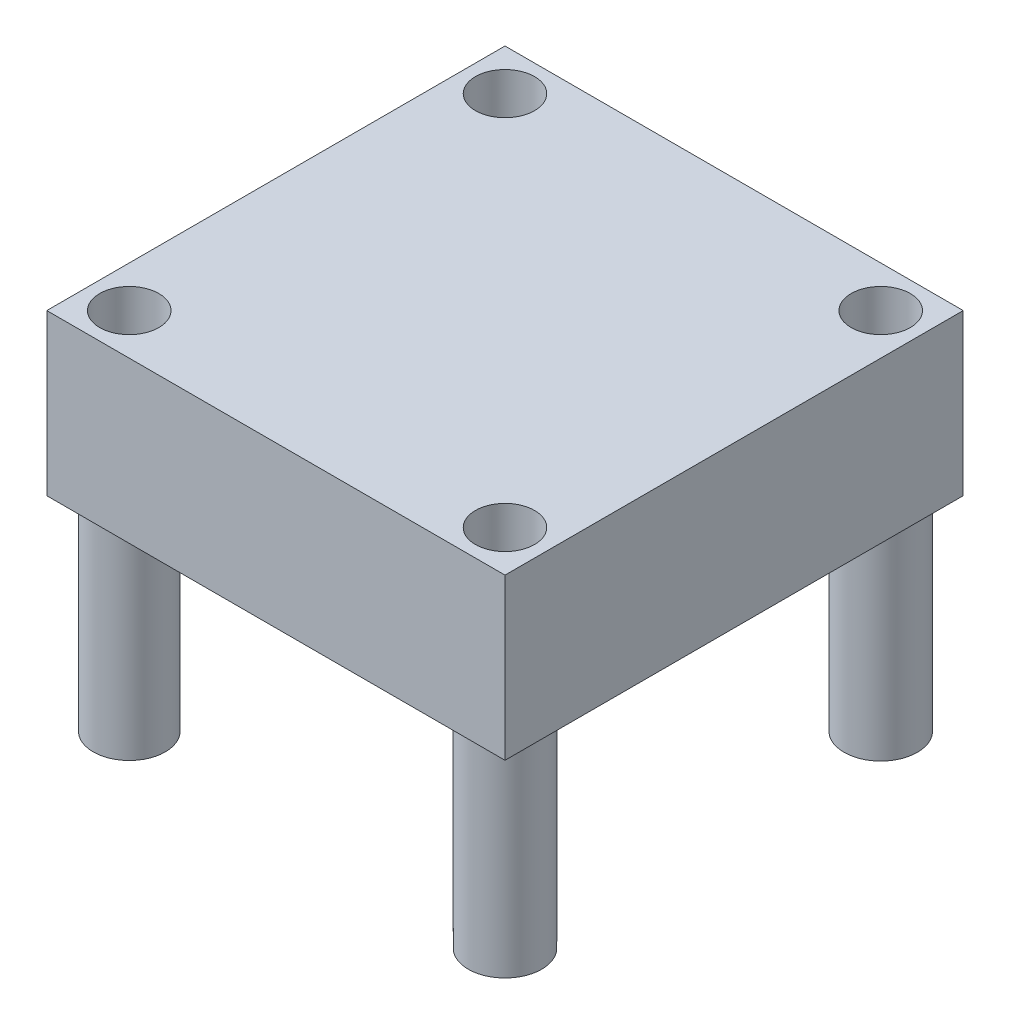
ISO-10303-21;
HEADER;
FILE_DESCRIPTION(('STEP AP214'),'2;1');
FILE_NAME('part.step','',(''),(''),'','','');
FILE_SCHEMA(('AUTOMOTIVE_DESIGN { 1 0 10303 214 1 1 1 1 }'));
ENDSEC;
DATA;
#1=APPLICATION_CONTEXT('core data for automotive mechanical design processes');
#2=APPLICATION_PROTOCOL_DEFINITION('international standard','automotive_design',2000,#1);
#3=PRODUCT_CONTEXT('',#1,'mechanical');
#4=PRODUCT('Part','Part','',(#3));
#5=PRODUCT_RELATED_PRODUCT_CATEGORY('part','',(#4));
#6=PRODUCT_DEFINITION_FORMATION('','',#4);
#7=PRODUCT_DEFINITION_CONTEXT('part definition',#1,'design');
#8=PRODUCT_DEFINITION('design','',#6,#7);
#9=PRODUCT_DEFINITION_SHAPE('','',#8);
#10=(LENGTH_UNIT() NAMED_UNIT(*) SI_UNIT(.MILLI.,.METRE.));
#11=(NAMED_UNIT(*) PLANE_ANGLE_UNIT() SI_UNIT($,.RADIAN.));
#12=(NAMED_UNIT(*) SI_UNIT($,.STERADIAN.) SOLID_ANGLE_UNIT());
#13=UNCERTAINTY_MEASURE_WITH_UNIT(LENGTH_MEASURE(1.E-05),#10,'distance_accuracy_value','');
#14=(GEOMETRIC_REPRESENTATION_CONTEXT(3) GLOBAL_UNCERTAINTY_ASSIGNED_CONTEXT((#13)) GLOBAL_UNIT_ASSIGNED_CONTEXT((#10,
#11,#12)) REPRESENTATION_CONTEXT('',''));
#15=CARTESIAN_POINT('',(0.,0.,0.));
#16=DIRECTION('',(0.,0.,1.));
#17=DIRECTION('',(1.,0.,0.));
#18=AXIS2_PLACEMENT_3D('',#15,#16,#17);
#19=CARTESIAN_POINT('',(-16.8639448621554,8.89,-11.4760573934837));
#20=DIRECTION('',(1.,0.,0.));
#21=DIRECTION('',(0.,0.,-1.));
#22=AXIS2_PLACEMENT_3D('',#19,#20,#21);
#23=PLANE('',#22);
#24=DIRECTION('',(0.,0.,1.));
#25=VECTOR('',#24,1.);
#26=CARTESIAN_POINT('',(-16.8639448621554,0.,-11.4760573934837));
#27=LINE('',#26,#25);
#28=CARTESIAN_POINT('',(-16.8639448621554,0.,-11.4760573934837));
#29=VERTEX_POINT('',#28);
#30=CARTESIAN_POINT('',(-16.8639448621554,0.,13.9239426065163));
#31=VERTEX_POINT('',#30);
#32=EDGE_CURVE('E104',#29,#31,#27,.T.);
#33=ORIENTED_EDGE('',*,*,#32,.T.);
#34=DIRECTION('',(0.,-1.,0.));
#35=VECTOR('',#34,1.);
#36=CARTESIAN_POINT('',(-16.8639448621554,8.89,13.9239426065163));
#37=LINE('',#36,#35);
#38=CARTESIAN_POINT('',(-16.8639448621554,8.89,13.9239426065163));
#39=VERTEX_POINT('',#38);
#40=EDGE_CURVE('E95',#39,#31,#37,.T.);
#41=ORIENTED_EDGE('',*,*,#40,.F.);
#42=DIRECTION('',(0.,0.,1.));
#43=VECTOR('',#42,1.);
#44=CARTESIAN_POINT('',(-16.8639448621554,8.89,-11.4760573934837));
#45=LINE('',#44,#43);
#46=CARTESIAN_POINT('',(-16.8639448621554,8.89,-11.4760573934837));
#47=VERTEX_POINT('',#46);
#48=EDGE_CURVE('E89',#47,#39,#45,.T.);
#49=ORIENTED_EDGE('',*,*,#48,.F.);
#50=DIRECTION('',(0.,-1.,0.));
#51=VECTOR('',#50,1.);
#52=CARTESIAN_POINT('',(-16.8639448621554,8.89,-11.4760573934837));
#53=LINE('',#52,#51);
#54=EDGE_CURVE('E100',#47,#29,#53,.T.);
#55=ORIENTED_EDGE('',*,*,#54,.T.);
#56=EDGE_LOOP('',(#33,#41,#49,#55));
#57=FACE_BOUND('',#56,.T.);
#58=ADVANCED_FACE('F37',(#57),#23,.F.);
#59=CARTESIAN_POINT('',(-16.8639448621554,8.89,13.9239426065163));
#60=DIRECTION('',(0.,0.,-1.));
#61=DIRECTION('',(-1.,0.,0.));
#62=AXIS2_PLACEMENT_3D('',#59,#60,#61);
#63=PLANE('',#62);
#64=DIRECTION('',(1.,0.,0.));
#65=VECTOR('',#64,1.);
#66=CARTESIAN_POINT('',(-16.8639448621554,0.,13.9239426065163));
#67=LINE('',#66,#65);
#68=CARTESIAN_POINT('',(8.53605513784461,0.,13.9239426065163));
#69=VERTEX_POINT('',#68);
#70=EDGE_CURVE('E94',#31,#69,#67,.T.);
#71=ORIENTED_EDGE('',*,*,#70,.T.);
#72=DIRECTION('',(0.,-1.,0.));
#73=VECTOR('',#72,1.);
#74=CARTESIAN_POINT('',(8.53605513784461,8.89,13.9239426065163));
#75=LINE('',#74,#73);
#76=CARTESIAN_POINT('',(8.53605513784461,8.89,13.9239426065163));
#77=VERTEX_POINT('',#76);
#78=EDGE_CURVE('E92',#77,#69,#75,.T.);
#79=ORIENTED_EDGE('',*,*,#78,.F.);
#80=DIRECTION('',(1.,0.,0.));
#81=VECTOR('',#80,1.);
#82=CARTESIAN_POINT('',(-16.8639448621554,8.89,13.9239426065163));
#83=LINE('',#82,#81);
#84=EDGE_CURVE('E84',#39,#77,#83,.T.);
#85=ORIENTED_EDGE('',*,*,#84,.F.);
#86=ORIENTED_EDGE('',*,*,#40,.T.);
#87=EDGE_LOOP('',(#71,#79,#85,#86));
#88=FACE_BOUND('',#87,.T.);
#89=ADVANCED_FACE('F93',(#88),#63,.F.);
#90=CARTESIAN_POINT('',(8.53605513784461,8.89,-11.4760573934837));
#91=DIRECTION('',(-1.,0.,0.));
#92=DIRECTION('',(0.,0.,1.));
#93=AXIS2_PLACEMENT_3D('',#90,#91,#92);
#94=PLANE('',#93);
#95=DIRECTION('',(0.,0.,-1.));
#96=VECTOR('',#95,1.);
#97=CARTESIAN_POINT('',(8.53605513784461,0.,-11.4760573934837));
#98=LINE('',#97,#96);
#99=CARTESIAN_POINT('',(8.53605513784461,0.,-11.4760573934837));
#100=VERTEX_POINT('',#99);
#101=EDGE_CURVE('E70',#69,#100,#98,.T.);
#102=ORIENTED_EDGE('',*,*,#101,.T.);
#103=DIRECTION('',(0.,-1.,0.));
#104=VECTOR('',#103,1.);
#105=CARTESIAN_POINT('',(8.53605513784461,8.89,-11.4760573934837));
#106=LINE('',#105,#104);
#107=CARTESIAN_POINT('',(8.53605513784461,8.89,-11.4760573934837));
#108=VERTEX_POINT('',#107);
#109=EDGE_CURVE('E96',#108,#100,#106,.T.);
#110=ORIENTED_EDGE('',*,*,#109,.F.);
#111=DIRECTION('',(0.,0.,-1.));
#112=VECTOR('',#111,1.);
#113=CARTESIAN_POINT('',(8.53605513784461,8.89,-11.4760573934837));
#114=LINE('',#113,#112);
#115=EDGE_CURVE('E87',#77,#108,#114,.T.);
#116=ORIENTED_EDGE('',*,*,#115,.F.);
#117=ORIENTED_EDGE('',*,*,#78,.T.);
#118=EDGE_LOOP('',(#102,#110,#116,#117));
#119=FACE_BOUND('',#118,.T.);
#120=ADVANCED_FACE('F98',(#119),#94,.F.);
#121=CARTESIAN_POINT('',(-16.8639448621554,8.89,-11.4760573934837));
#122=DIRECTION('',(0.,0.,1.));
#123=DIRECTION('',(1.,0.,0.));
#124=AXIS2_PLACEMENT_3D('',#121,#122,#123);
#125=PLANE('',#124);
#126=DIRECTION('',(-1.,0.,0.));
#127=VECTOR('',#126,1.);
#128=CARTESIAN_POINT('',(-16.8639448621554,0.,-11.4760573934837));
#129=LINE('',#128,#127);
#130=EDGE_CURVE('E76',#100,#29,#129,.T.);
#131=ORIENTED_EDGE('',*,*,#130,.T.);
#132=ORIENTED_EDGE('',*,*,#54,.F.);
#133=DIRECTION('',(-1.,0.,0.));
#134=VECTOR('',#133,1.);
#135=CARTESIAN_POINT('',(-16.8639448621554,8.89,-11.4760573934837));
#136=LINE('',#135,#134);
#137=EDGE_CURVE('E53',#108,#47,#136,.T.);
#138=ORIENTED_EDGE('',*,*,#137,.F.);
#139=ORIENTED_EDGE('',*,*,#109,.T.);
#140=EDGE_LOOP('',(#131,#132,#138,#139));
#141=FACE_BOUND('',#140,.T.);
#142=ADVANCED_FACE('F136',(#141),#125,.F.);
#143=CARTESIAN_POINT('',(0.,8.89,0.));
#144=DIRECTION('',(0.,1.,0.));
#145=DIRECTION('',(0.,0.,1.));
#146=AXIS2_PLACEMENT_3D('',#143,#144,#145);
#147=PLANE('',#146);
#148=CARTESIAN_POINT('',(6.25005513784461,8.89,11.6379426065163));
#149=DIRECTION('',(0.,-1.,0.));
#150=DIRECTION('',(0.,0.,-1.));
#151=AXIS2_PLACEMENT_3D('',#148,#149,#150);
#152=CIRCLE('',#151,1.6383);
#153=CARTESIAN_POINT('',(6.25005513784461,8.89,9.99964260651628));
#154=VERTEX_POINT('',#153);
#155=EDGE_CURVE('E373',#154,#154,#152,.T.);
#156=ORIENTED_EDGE('',*,*,#155,.T.);
#157=EDGE_LOOP('',(#156));
#158=FACE_BOUND('',#157,.T.);
#159=CARTESIAN_POINT('',(6.25005513784461,8.89,-9.19005739348371));
#160=DIRECTION('',(0.,-1.,0.));
#161=DIRECTION('',(0.,0.,-1.));
#162=AXIS2_PLACEMENT_3D('',#159,#160,#161);
#163=CIRCLE('',#162,1.6383);
#164=CARTESIAN_POINT('',(6.25005513784461,8.89,-10.8283573934837));
#165=VERTEX_POINT('',#164);
#166=EDGE_CURVE('E379',#165,#165,#163,.T.);
#167=ORIENTED_EDGE('',*,*,#166,.T.);
#168=EDGE_LOOP('',(#167));
#169=FACE_BOUND('',#168,.T.);
#170=CARTESIAN_POINT('',(-14.5779448621554,8.89,-9.19005739348371));
#171=DIRECTION('',(0.,-1.,0.));
#172=DIRECTION('',(0.,0.,-1.));
#173=AXIS2_PLACEMENT_3D('',#170,#171,#172);
#174=CIRCLE('',#173,1.6383);
#175=CARTESIAN_POINT('',(-14.5779448621554,8.89,-10.8283573934837));
#176=VERTEX_POINT('',#175);
#177=EDGE_CURVE('E348',#176,#176,#174,.T.);
#178=ORIENTED_EDGE('',*,*,#177,.T.);
#179=EDGE_LOOP('',(#178));
#180=FACE_BOUND('',#179,.T.);
#181=CARTESIAN_POINT('',(-14.5779448621554,8.89,11.6379426065163));
#182=DIRECTION('',(0.,-1.,0.));
#183=DIRECTION('',(0.,0.,-1.));
#184=AXIS2_PLACEMENT_3D('',#181,#182,#183);
#185=CIRCLE('',#184,1.6383);
#186=CARTESIAN_POINT('',(-14.5779448621554,8.89,9.99964260651628));
#187=VERTEX_POINT('',#186);
#188=EDGE_CURVE('E339',#187,#187,#185,.T.);
#189=ORIENTED_EDGE('',*,*,#188,.T.);
#190=EDGE_LOOP('',(#189));
#191=FACE_BOUND('',#190,.T.);
#192=ORIENTED_EDGE('',*,*,#48,.T.);
#193=ORIENTED_EDGE('',*,*,#84,.T.);
#194=ORIENTED_EDGE('',*,*,#115,.T.);
#195=ORIENTED_EDGE('',*,*,#137,.T.);
#196=EDGE_LOOP('',(#192,#193,#194,#195));
#197=FACE_BOUND('',#196,.T.);
#198=ADVANCED_FACE('F85',(#158,#169,#180,#191,#197),#147,.T.);
#199=CARTESIAN_POINT('',(0.,0.,0.));
#200=DIRECTION('',(0.,1.,0.));
#201=DIRECTION('',(0.,0.,1.));
#202=AXIS2_PLACEMENT_3D('',#199,#200,#201);
#203=PLANE('',#202);
#204=CARTESIAN_POINT('',(-14.5779448621554,0.,-9.19005739348371));
#205=DIRECTION('',(0.,1.,0.));
#206=DIRECTION('',(0.,0.,1.));
#207=AXIS2_PLACEMENT_3D('',#204,#205,#206);
#208=CIRCLE('',#207,2.032);
#209=CARTESIAN_POINT('',(-14.5779448621554,0.,-7.15805739348371));
#210=VERTEX_POINT('',#209);
#211=EDGE_CURVE('E11',#210,#210,#208,.F.);
#212=ORIENTED_EDGE('',*,*,#211,.F.);
#213=EDGE_LOOP('',(#212));
#214=FACE_BOUND('',#213,.T.);
#215=CARTESIAN_POINT('',(6.25005513784461,0.,-9.19005739348371));
#216=DIRECTION('',(0.,1.,0.));
#217=DIRECTION('',(0.,0.,1.));
#218=AXIS2_PLACEMENT_3D('',#215,#216,#217);
#219=CIRCLE('',#218,2.032);
#220=CARTESIAN_POINT('',(6.25005513784461,0.,-7.15805739348371));
#221=VERTEX_POINT('',#220);
#222=EDGE_CURVE('E45',#221,#221,#219,.F.);
#223=ORIENTED_EDGE('',*,*,#222,.F.);
#224=EDGE_LOOP('',(#223));
#225=FACE_BOUND('',#224,.T.);
#226=CARTESIAN_POINT('',(6.25005513784461,0.,11.6379426065163));
#227=DIRECTION('',(0.,1.,0.));
#228=DIRECTION('',(0.,0.,1.));
#229=AXIS2_PLACEMENT_3D('',#226,#227,#228);
#230=CIRCLE('',#229,2.032);
#231=CARTESIAN_POINT('',(6.25005513784461,0.,13.6699426065163));
#232=VERTEX_POINT('',#231);
#233=EDGE_CURVE('E117',#232,#232,#230,.F.);
#234=ORIENTED_EDGE('',*,*,#233,.F.);
#235=EDGE_LOOP('',(#234));
#236=FACE_BOUND('',#235,.T.);
#237=CARTESIAN_POINT('',(-14.5779448621554,0.,11.6379426065163));
#238=DIRECTION('',(0.,1.,0.));
#239=DIRECTION('',(0.,0.,1.));
#240=AXIS2_PLACEMENT_3D('',#237,#238,#239);
#241=CIRCLE('',#240,1.9939);
#242=CARTESIAN_POINT('',(-14.5779448621554,0.,13.6318426065163));
#243=VERTEX_POINT('',#242);
#244=EDGE_CURVE('E114',#243,#243,#241,.F.);
#245=ORIENTED_EDGE('',*,*,#244,.F.);
#246=EDGE_LOOP('',(#245));
#247=FACE_BOUND('',#246,.T.);
#248=ORIENTED_EDGE('',*,*,#32,.F.);
#249=ORIENTED_EDGE('',*,*,#130,.F.);
#250=ORIENTED_EDGE('',*,*,#101,.F.);
#251=ORIENTED_EDGE('',*,*,#70,.F.);
#252=EDGE_LOOP('',(#248,#249,#250,#251));
#253=FACE_BOUND('',#252,.T.);
#254=ADVANCED_FACE('F124',(#214,#225,#236,#247,#253),#203,.F.);
#255=CARTESIAN_POINT('',(-14.5779448621554,-11.303,11.6379426065163));
#256=DIRECTION('',(0.,1.,0.));
#257=DIRECTION('',(0.,0.,1.));
#258=AXIS2_PLACEMENT_3D('',#255,#256,#257);
#259=CYLINDRICAL_SURFACE('',#258,1.9939);
#260=CARTESIAN_POINT('',(-14.5779448621554,-11.303,11.6379426065163));
#261=DIRECTION('',(0.,-1.,0.));
#262=DIRECTION('',(0.,0.,-1.));
#263=AXIS2_PLACEMENT_3D('',#260,#261,#262);
#264=CIRCLE('',#263,1.9939);
#265=CARTESIAN_POINT('',(-14.5779448621554,-11.303,9.64404260651629));
#266=VERTEX_POINT('',#265);
#267=EDGE_CURVE('E107',#266,#266,#264,.T.);
#268=ORIENTED_EDGE('',*,*,#267,.F.);
#269=EDGE_LOOP('',(#268));
#270=FACE_BOUND('',#269,.T.);
#271=ORIENTED_EDGE('',*,*,#244,.T.);
#272=EDGE_LOOP('',(#271));
#273=FACE_BOUND('',#272,.T.);
#274=ADVANCED_FACE('F127',(#270,#273),#259,.T.);
#275=CARTESIAN_POINT('',(-14.5779448621554,-11.303,11.6379426065163));
#276=DIRECTION('',(0.,-1.,0.));
#277=DIRECTION('',(0.,0.,-1.));
#278=AXIS2_PLACEMENT_3D('',#275,#276,#277);
#279=PLANE('',#278);
#280=CARTESIAN_POINT('',(-14.5779448621554,-11.303,11.6379426065163));
#281=DIRECTION('',(0.,-1.,0.));
#282=DIRECTION('',(0.,0.,-1.));
#283=AXIS2_PLACEMENT_3D('',#280,#281,#282);
#284=CIRCLE('',#283,1.6383);
#285=CARTESIAN_POINT('',(-14.5779448621554,-11.303,9.99964260651628));
#286=VERTEX_POINT('',#285);
#287=EDGE_CURVE('E342',#286,#286,#284,.T.);
#288=ORIENTED_EDGE('',*,*,#287,.F.);
#289=EDGE_LOOP('',(#288));
#290=FACE_BOUND('',#289,.T.);
#291=ORIENTED_EDGE('',*,*,#267,.T.);
#292=EDGE_LOOP('',(#291));
#293=FACE_BOUND('',#292,.T.);
#294=ADVANCED_FACE('F179',(#290,#293),#279,.T.);
#295=CARTESIAN_POINT('',(6.25005513784461,-11.303,11.6379426065163));
#296=DIRECTION('',(0.,1.,0.));
#297=DIRECTION('',(0.,0.,1.));
#298=AXIS2_PLACEMENT_3D('',#295,#296,#297);
#299=CYLINDRICAL_SURFACE('',#298,2.032);
#300=CARTESIAN_POINT('',(6.25005513784461,-11.303,11.6379426065163));
#301=DIRECTION('',(0.,-1.,0.));
#302=DIRECTION('',(0.,0.,-1.));
#303=AXIS2_PLACEMENT_3D('',#300,#301,#302);
#304=CIRCLE('',#303,2.032);
#305=CARTESIAN_POINT('',(6.25005513784461,-11.303,9.60594260651629));
#306=VERTEX_POINT('',#305);
#307=EDGE_CURVE('E357',#306,#306,#304,.T.);
#308=ORIENTED_EDGE('',*,*,#307,.F.);
#309=EDGE_LOOP('',(#308));
#310=FACE_BOUND('',#309,.T.);
#311=ORIENTED_EDGE('',*,*,#233,.T.);
#312=EDGE_LOOP('',(#311));
#313=FACE_BOUND('',#312,.T.);
#314=ADVANCED_FACE('F188',(#310,#313),#299,.T.);
#315=CARTESIAN_POINT('',(6.25005513784461,-11.303,11.6379426065163));
#316=DIRECTION('',(0.,-1.,0.));
#317=DIRECTION('',(0.,0.,-1.));
#318=AXIS2_PLACEMENT_3D('',#315,#316,#317);
#319=PLANE('',#318);
#320=CARTESIAN_POINT('',(6.25005513784461,-11.303,11.6379426065163));
#321=DIRECTION('',(0.,-1.,0.));
#322=DIRECTION('',(0.,0.,-1.));
#323=AXIS2_PLACEMENT_3D('',#320,#321,#322);
#324=CIRCLE('',#323,1.6383);
#325=CARTESIAN_POINT('',(6.25005513784461,-11.303,9.99964260651628));
#326=VERTEX_POINT('',#325);
#327=EDGE_CURVE('E376',#326,#326,#324,.T.);
#328=ORIENTED_EDGE('',*,*,#327,.F.);
#329=EDGE_LOOP('',(#328));
#330=FACE_BOUND('',#329,.T.);
#331=ORIENTED_EDGE('',*,*,#307,.T.);
#332=EDGE_LOOP('',(#331));
#333=FACE_BOUND('',#332,.T.);
#334=ADVANCED_FACE('F193',(#330,#333),#319,.T.);
#335=CARTESIAN_POINT('',(6.25005513784461,-11.303,-9.19005739348371));
#336=DIRECTION('',(0.,1.,0.));
#337=DIRECTION('',(0.,0.,1.));
#338=AXIS2_PLACEMENT_3D('',#335,#336,#337);
#339=CYLINDRICAL_SURFACE('',#338,2.032);
#340=CARTESIAN_POINT('',(6.25005513784461,-11.303,-9.19005739348371));
#341=DIRECTION('',(0.,-1.,0.));
#342=DIRECTION('',(0.,0.,-1.));
#343=AXIS2_PLACEMENT_3D('',#340,#341,#342);
#344=CIRCLE('',#343,2.032);
#345=CARTESIAN_POINT('',(6.25005513784461,-11.303,-11.2220573934837));
#346=VERTEX_POINT('',#345);
#347=EDGE_CURVE('E354',#346,#346,#344,.T.);
#348=ORIENTED_EDGE('',*,*,#347,.F.);
#349=EDGE_LOOP('',(#348));
#350=FACE_BOUND('',#349,.T.);
#351=ORIENTED_EDGE('',*,*,#222,.T.);
#352=EDGE_LOOP('',(#351));
#353=FACE_BOUND('',#352,.T.);
#354=ADVANCED_FACE('F122',(#350,#353),#339,.T.);
#355=CARTESIAN_POINT('',(6.25005513784461,-11.303,-9.19005739348371));
#356=DIRECTION('',(0.,-1.,0.));
#357=DIRECTION('',(0.,0.,-1.));
#358=AXIS2_PLACEMENT_3D('',#355,#356,#357);
#359=PLANE('',#358);
#360=CARTESIAN_POINT('',(6.25005513784461,-11.303,-9.19005739348371));
#361=DIRECTION('',(0.,-1.,0.));
#362=DIRECTION('',(0.,0.,-1.));
#363=AXIS2_PLACEMENT_3D('',#360,#361,#362);
#364=CIRCLE('',#363,1.6383);
#365=CARTESIAN_POINT('',(6.25005513784461,-11.303,-10.8283573934837));
#366=VERTEX_POINT('',#365);
#367=EDGE_CURVE('E382',#366,#366,#364,.T.);
#368=ORIENTED_EDGE('',*,*,#367,.F.);
#369=EDGE_LOOP('',(#368));
#370=FACE_BOUND('',#369,.T.);
#371=ORIENTED_EDGE('',*,*,#347,.T.);
#372=EDGE_LOOP('',(#371));
#373=FACE_BOUND('',#372,.T.);
#374=ADVANCED_FACE('F206',(#370,#373),#359,.T.);
#375=CARTESIAN_POINT('',(-14.5779448621554,-11.303,-9.19005739348371));
#376=DIRECTION('',(0.,1.,0.));
#377=DIRECTION('',(0.,0.,1.));
#378=AXIS2_PLACEMENT_3D('',#375,#376,#377);
#379=CYLINDRICAL_SURFACE('',#378,2.032);
#380=CARTESIAN_POINT('',(-14.5779448621554,-11.303,-9.19005739348371));
#381=DIRECTION('',(0.,-1.,0.));
#382=DIRECTION('',(0.,0.,-1.));
#383=AXIS2_PLACEMENT_3D('',#380,#381,#382);
#384=CIRCLE('',#383,2.032);
#385=CARTESIAN_POINT('',(-14.5779448621554,-11.303,-11.2220573934837));
#386=VERTEX_POINT('',#385);
#387=EDGE_CURVE('E345',#386,#386,#384,.T.);
#388=ORIENTED_EDGE('',*,*,#387,.F.);
#389=EDGE_LOOP('',(#388));
#390=FACE_BOUND('',#389,.T.);
#391=ORIENTED_EDGE('',*,*,#211,.T.);
#392=EDGE_LOOP('',(#391));
#393=FACE_BOUND('',#392,.T.);
#394=ADVANCED_FACE('F215',(#390,#393),#379,.T.);
#395=CARTESIAN_POINT('',(-14.5779448621554,-11.303,-9.19005739348371));
#396=DIRECTION('',(0.,-1.,0.));
#397=DIRECTION('',(0.,0.,-1.));
#398=AXIS2_PLACEMENT_3D('',#395,#396,#397);
#399=PLANE('',#398);
#400=CARTESIAN_POINT('',(-14.5779448621554,-11.303,-9.19005739348371));
#401=DIRECTION('',(0.,-1.,0.));
#402=DIRECTION('',(0.,0.,-1.));
#403=AXIS2_PLACEMENT_3D('',#400,#401,#402);
#404=CIRCLE('',#403,1.6383);
#405=CARTESIAN_POINT('',(-14.5779448621554,-11.303,-10.8283573934837));
#406=VERTEX_POINT('',#405);
#407=EDGE_CURVE('E343',#406,#406,#404,.T.);
#408=ORIENTED_EDGE('',*,*,#407,.F.);
#409=EDGE_LOOP('',(#408));
#410=FACE_BOUND('',#409,.T.);
#411=ORIENTED_EDGE('',*,*,#387,.T.);
#412=EDGE_LOOP('',(#411));
#413=FACE_BOUND('',#412,.T.);
#414=ADVANCED_FACE('F220',(#410,#413),#399,.T.);
#415=CARTESIAN_POINT('',(-14.5779448621554,8.89,-9.19005739348371));
#416=DIRECTION('',(0.,-1.,0.));
#417=DIRECTION('',(0.,0.,-1.));
#418=AXIS2_PLACEMENT_3D('',#415,#416,#417);
#419=CYLINDRICAL_SURFACE('',#418,1.6383);
#420=ORIENTED_EDGE('',*,*,#177,.F.);
#421=EDGE_LOOP('',(#420));
#422=FACE_BOUND('',#421,.T.);
#423=ORIENTED_EDGE('',*,*,#407,.T.);
#424=EDGE_LOOP('',(#423));
#425=FACE_BOUND('',#424,.T.);
#426=ADVANCED_FACE('F261',(#422,#425),#419,.F.);
#427=CARTESIAN_POINT('',(6.25005513784461,8.89,-9.19005739348371));
#428=DIRECTION('',(0.,-1.,0.));
#429=DIRECTION('',(0.,0.,-1.));
#430=AXIS2_PLACEMENT_3D('',#427,#428,#429);
#431=CYLINDRICAL_SURFACE('',#430,1.6383);
#432=ORIENTED_EDGE('',*,*,#166,.F.);
#433=EDGE_LOOP('',(#432));
#434=FACE_BOUND('',#433,.T.);
#435=ORIENTED_EDGE('',*,*,#367,.T.);
#436=EDGE_LOOP('',(#435));
#437=FACE_BOUND('',#436,.T.);
#438=ADVANCED_FACE('F272',(#434,#437),#431,.F.);
#439=CARTESIAN_POINT('',(6.25005513784461,8.89,11.6379426065163));
#440=DIRECTION('',(0.,-1.,0.));
#441=DIRECTION('',(0.,0.,-1.));
#442=AXIS2_PLACEMENT_3D('',#439,#440,#441);
#443=CYLINDRICAL_SURFACE('',#442,1.6383);
#444=ORIENTED_EDGE('',*,*,#155,.F.);
#445=EDGE_LOOP('',(#444));
#446=FACE_BOUND('',#445,.T.);
#447=ORIENTED_EDGE('',*,*,#327,.T.);
#448=EDGE_LOOP('',(#447));
#449=FACE_BOUND('',#448,.T.);
#450=ADVANCED_FACE('F283',(#446,#449),#443,.F.);
#451=CARTESIAN_POINT('',(-14.5779448621554,8.89,11.6379426065163));
#452=DIRECTION('',(0.,-1.,0.));
#453=DIRECTION('',(0.,0.,-1.));
#454=AXIS2_PLACEMENT_3D('',#451,#452,#453);
#455=CYLINDRICAL_SURFACE('',#454,1.6383);
#456=ORIENTED_EDGE('',*,*,#188,.F.);
#457=EDGE_LOOP('',(#456));
#458=FACE_BOUND('',#457,.T.);
#459=ORIENTED_EDGE('',*,*,#287,.T.);
#460=EDGE_LOOP('',(#459));
#461=FACE_BOUND('',#460,.T.);
#462=ADVANCED_FACE('F294',(#458,#461),#455,.F.);
#463=CLOSED_SHELL('',(#58,#89,#120,#142,#198,#254,#274,#294,#314,#334,#354,#374,#394,#414,#426,
#438,#450,#462));
#464=MANIFOLD_SOLID_BREP('B2',#463);
#465=ADVANCED_BREP_SHAPE_REPRESENTATION('',(#18,#464),#14);
#466=SHAPE_DEFINITION_REPRESENTATION(#9,#465);
ENDSEC;
END-ISO-10303-21;
